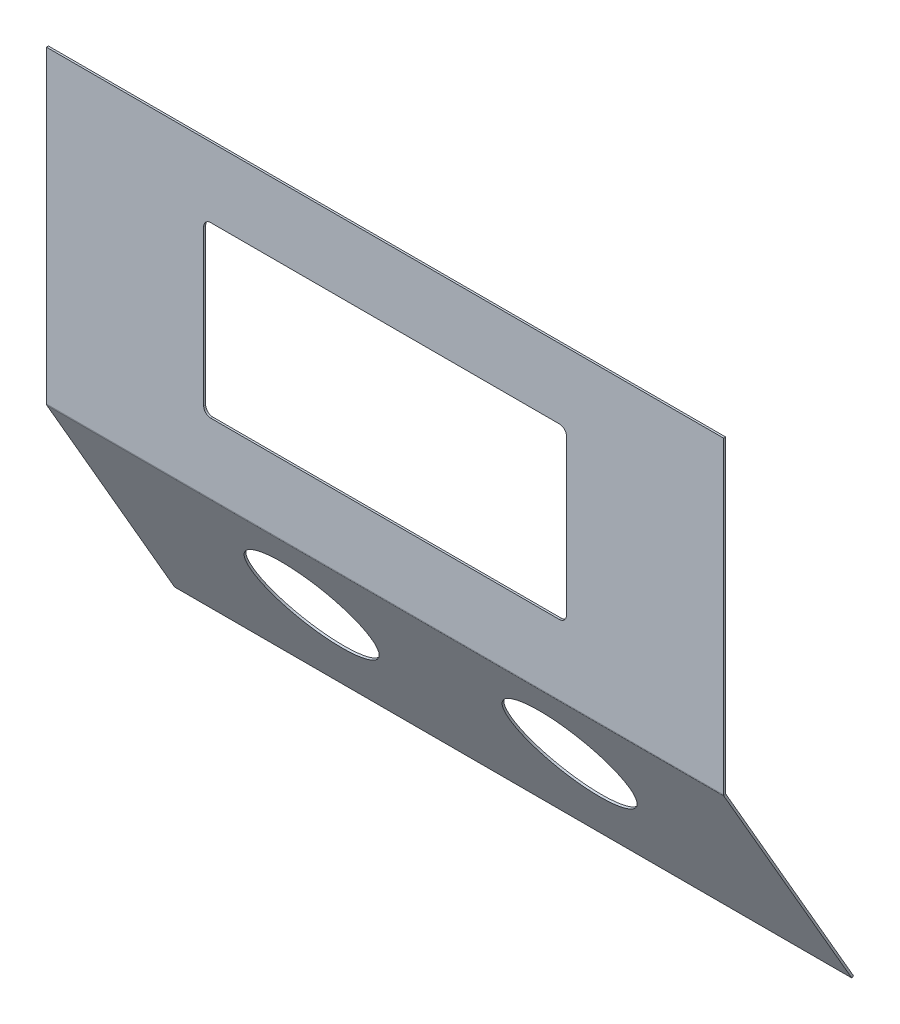
ISO-10303-21;
HEADER;
FILE_DESCRIPTION(('STEP AP214'),'2;1');
FILE_NAME('part.step','',(''),(''),'','','');
FILE_SCHEMA(('AUTOMOTIVE_DESIGN { 1 0 10303 214 1 1 1 1 }'));
ENDSEC;
DATA;
#1=APPLICATION_CONTEXT('core data for automotive mechanical design processes');
#2=APPLICATION_PROTOCOL_DEFINITION('international standard','automotive_design',2000,#1);
#3=PRODUCT_CONTEXT('',#1,'mechanical');
#4=PRODUCT('Part','Part','',(#3));
#5=PRODUCT_RELATED_PRODUCT_CATEGORY('part','',(#4));
#6=PRODUCT_DEFINITION_FORMATION('','',#4);
#7=PRODUCT_DEFINITION_CONTEXT('part definition',#1,'design');
#8=PRODUCT_DEFINITION('design','',#6,#7);
#9=PRODUCT_DEFINITION_SHAPE('','',#8);
#10=(LENGTH_UNIT() NAMED_UNIT(*) SI_UNIT(.MILLI.,.METRE.));
#11=(NAMED_UNIT(*) PLANE_ANGLE_UNIT() SI_UNIT($,.RADIAN.));
#12=(NAMED_UNIT(*) SI_UNIT($,.STERADIAN.) SOLID_ANGLE_UNIT());
#13=UNCERTAINTY_MEASURE_WITH_UNIT(LENGTH_MEASURE(1.E-05),#10,'distance_accuracy_value','');
#14=(GEOMETRIC_REPRESENTATION_CONTEXT(3) GLOBAL_UNCERTAINTY_ASSIGNED_CONTEXT((#13)) GLOBAL_UNIT_ASSIGNED_CONTEXT((#10,
#11,#12)) REPRESENTATION_CONTEXT('',''));
#15=CARTESIAN_POINT('',(0.,0.,0.));
#16=DIRECTION('',(0.,0.,1.));
#17=DIRECTION('',(1.,0.,0.));
#18=AXIS2_PLACEMENT_3D('',#15,#16,#17);
#19=CARTESIAN_POINT('',(-533.4,-388.943917309577,-198.66447275902));
#20=DIRECTION('',(0.,0.866025403784438,0.500000000000001));
#21=DIRECTION('',(0.,-0.500000000000001,0.866025403784438));
#22=AXIS2_PLACEMENT_3D('',#19,#20,#21);
#23=PLANE('',#22);
#24=DIRECTION('',(1.,0.,0.));
#25=VECTOR('',#24,1.);
#26=CARTESIAN_POINT('',(-533.4,-387.356417309577,-201.414103416036));
#27=LINE('',#26,#25);
#28=CARTESIAN_POINT('',(-533.4,-387.356417309577,-201.414103416036));
#29=VERTEX_POINT('',#28);
#30=CARTESIAN_POINT('',(533.4,-387.356417309577,-201.414103416036));
#31=VERTEX_POINT('',#30);
#32=EDGE_CURVE('E269',#29,#31,#27,.T.);
#33=ORIENTED_EDGE('',*,*,#32,.T.);
#34=DIRECTION('',(0.,0.500000000000001,-0.866025403784438));
#35=VECTOR('',#34,1.);
#36=CARTESIAN_POINT('',(533.4,-388.943917309577,-198.66447275902));
#37=LINE('',#36,#35);
#38=CARTESIAN_POINT('',(533.4,-388.943917309577,-198.66447275902));
#39=VERTEX_POINT('',#38);
#40=EDGE_CURVE('E263',#39,#31,#37,.T.);
#41=ORIENTED_EDGE('',*,*,#40,.F.);
#42=DIRECTION('',(1.,0.,0.));
#43=VECTOR('',#42,1.);
#44=CARTESIAN_POINT('',(-533.4,-388.943917309577,-198.66447275902));
#45=LINE('',#44,#43);
#46=CARTESIAN_POINT('',(-533.4,-388.943917309577,-198.66447275902));
#47=VERTEX_POINT('',#46);
#48=EDGE_CURVE('E46',#47,#39,#45,.T.);
#49=ORIENTED_EDGE('',*,*,#48,.F.);
#50=DIRECTION('',(0.,0.500000000000001,-0.866025403784438));
#51=VECTOR('',#50,1.);
#52=CARTESIAN_POINT('',(-533.4,-388.943917309577,-198.66447275902));
#53=LINE('',#52,#51);
#54=EDGE_CURVE('E266',#47,#29,#53,.T.);
#55=ORIENTED_EDGE('',*,*,#54,.T.);
#56=EDGE_LOOP('',(#33,#41,#49,#55));
#57=FACE_BOUND('',#56,.T.);
#58=ADVANCED_FACE('F37',(#57),#23,.F.);
#59=CARTESIAN_POINT('',(533.4,387.826743297328,249.80427724098));
#60=DIRECTION('',(-1.,0.,0.));
#61=DIRECTION('',(0.,-0.866025403784438,-0.500000000000001));
#62=AXIS2_PLACEMENT_3D('',#59,#60,#61);
#63=PLANE('',#62);
#64=DIRECTION('',(0.,0.500000000000001,-0.866025403784438));
#65=VECTOR('',#64,1.);
#66=CARTESIAN_POINT('',(533.4,-40.2907499999998,2.63052724097997));
#67=LINE('',#66,#65);
#68=CARTESIAN_POINT('',(533.4,-40.2907499999998,2.63052724097997));
#69=VERTEX_POINT('',#68);
#70=CARTESIAN_POINT('',(533.4,-38.7032499999998,-0.119103416035633));
#71=VERTEX_POINT('',#70);
#72=EDGE_CURVE('E41',#69,#71,#67,.T.);
#73=ORIENTED_EDGE('',*,*,#72,.F.);
#74=DIRECTION('',(0.,0.866025403784438,0.500000000000001));
#75=VECTOR('',#74,1.);
#76=CARTESIAN_POINT('',(533.4,387.826743297328,249.80427724098));
#77=LINE('',#76,#75);
#78=EDGE_CURVE('E257',#39,#69,#77,.T.);
#79=ORIENTED_EDGE('',*,*,#78,.F.);
#80=ORIENTED_EDGE('',*,*,#40,.T.);
#81=DIRECTION('',(0.,0.866025403784438,0.500000000000001));
#82=VECTOR('',#81,1.);
#83=CARTESIAN_POINT('',(533.4,389.414243297328,247.054646583965));
#84=LINE('',#83,#82);
#85=EDGE_CURVE('E260',#31,#71,#84,.T.);
#86=ORIENTED_EDGE('',*,*,#85,.T.);
#87=EDGE_LOOP('',(#73,#79,#80,#86));
#88=FACE_BOUND('',#87,.T.);
#89=ADVANCED_FACE('F288',(#88),#63,.F.);
#90=CARTESIAN_POINT('',(0.,-0.558587006124695,25.5699022409799));
#91=DIRECTION('',(0.,-0.500000000000001,0.866025403784438));
#92=DIRECTION('',(1.,0.,0.));
#93=AXIS2_PLACEMENT_3D('',#90,#91,#92);
#94=PLANE('',#93);
#95=CARTESIAN_POINT('',(-203.2,-190.970510004454,-84.3644727590201));
#96=DIRECTION('',(0.,-0.500000000000001,0.866025403784438));
#97=DIRECTION('',(0.,-0.866025403784438,-0.500000000000001));
#98=AXIS2_PLACEMENT_3D('',#95,#96,#97);
#99=CIRCLE('',#98,95.25);
#100=CARTESIAN_POINT('',(-203.2,-273.459429714922,-131.98947275902));
#101=VERTEX_POINT('',#100);
#102=EDGE_CURVE('E612',#101,#101,#99,.T.);
#103=ORIENTED_EDGE('',*,*,#102,.F.);
#104=EDGE_LOOP('',(#103));
#105=FACE_BOUND('',#104,.T.);
#106=CARTESIAN_POINT('',(203.2,-190.970510004454,-84.3644727590201));
#107=DIRECTION('',(0.,-0.500000000000001,0.866025403784438));
#108=DIRECTION('',(0.,-0.866025403784438,-0.500000000000001));
#109=AXIS2_PLACEMENT_3D('',#106,#107,#108);
#110=CIRCLE('',#109,95.25);
#111=CARTESIAN_POINT('',(203.2,-273.459429714922,-131.98947275902));
#112=VERTEX_POINT('',#111);
#113=EDGE_CURVE('E356',#112,#112,#110,.T.);
#114=ORIENTED_EDGE('',*,*,#113,.F.);
#115=EDGE_LOOP('',(#114));
#116=FACE_BOUND('',#115,.T.);
#117=ORIENTED_EDGE('',*,*,#78,.T.);
#118=DIRECTION('',(-1.,0.,0.));
#119=VECTOR('',#118,1.);
#120=CARTESIAN_POINT('',(0.,-40.2907499999999,2.63052724097996));
#121=LINE('',#120,#119);
#122=CARTESIAN_POINT('',(-533.4,-40.2907499999998,2.63052724098005));
#123=VERTEX_POINT('',#122);
#124=EDGE_CURVE('E254',#69,#123,#121,.T.);
#125=ORIENTED_EDGE('',*,*,#124,.T.);
#126=DIRECTION('',(0.,-0.866025403784438,-0.500000000000001));
#127=VECTOR('',#126,1.);
#128=CARTESIAN_POINT('',(-533.4,387.826743297328,249.80427724098));
#129=LINE('',#128,#127);
#130=EDGE_CURVE('E252',#123,#47,#129,.T.);
#131=ORIENTED_EDGE('',*,*,#130,.T.);
#132=ORIENTED_EDGE('',*,*,#48,.T.);
#133=EDGE_LOOP('',(#117,#125,#131,#132));
#134=FACE_BOUND('',#133,.T.);
#135=ADVANCED_FACE('F302',(#105,#116,#134),#94,.T.);
#136=CARTESIAN_POINT('',(-533.4,387.826743297328,249.80427724098));
#137=DIRECTION('',(1.,0.,0.));
#138=DIRECTION('',(0.,0.500000000000001,-0.866025403784438));
#139=AXIS2_PLACEMENT_3D('',#136,#137,#138);
#140=PLANE('',#139);
#141=DIRECTION('',(0.,-0.500000000000001,0.866025403784438));
#142=VECTOR('',#141,1.);
#143=CARTESIAN_POINT('',(-533.4,-40.2907499999999,2.63052724097997));
#144=LINE('',#143,#142);
#145=CARTESIAN_POINT('',(-533.4,-38.7032499999999,-0.11910341603563));
#146=VERTEX_POINT('',#145);
#147=EDGE_CURVE('E271',#146,#123,#144,.T.);
#148=ORIENTED_EDGE('',*,*,#147,.F.);
#149=DIRECTION('',(0.,-0.866025403784438,-0.500000000000001));
#150=VECTOR('',#149,1.);
#151=CARTESIAN_POINT('',(-533.4,389.414243297328,247.054646583965));
#152=LINE('',#151,#150);
#153=EDGE_CURVE('E11',#146,#29,#152,.T.);
#154=ORIENTED_EDGE('',*,*,#153,.T.);
#155=ORIENTED_EDGE('',*,*,#54,.F.);
#156=ORIENTED_EDGE('',*,*,#130,.F.);
#157=EDGE_LOOP('',(#148,#154,#155,#156));
#158=FACE_BOUND('',#157,.T.);
#159=ADVANCED_FACE('F296',(#158),#140,.F.);
#160=CARTESIAN_POINT('',(0.,1.02891299387531,22.8202715839643));
#161=DIRECTION('',(0.,-0.500000000000001,0.866025403784438));
#162=DIRECTION('',(1.,0.,0.));
#163=AXIS2_PLACEMENT_3D('',#160,#161,#162);
#164=PLANE('',#163);
#165=CARTESIAN_POINT('',(-203.2,-189.383010004454,-87.1141034160357));
#166=DIRECTION('',(0.,-0.500000000000001,0.866025403784438));
#167=DIRECTION('',(0.,-0.866025403784438,-0.500000000000001));
#168=AXIS2_PLACEMENT_3D('',#165,#166,#167);
#169=CIRCLE('',#168,95.25);
#170=CARTESIAN_POINT('',(-203.2,-271.871929714922,-134.739103416036));
#171=VERTEX_POINT('',#170);
#172=EDGE_CURVE('E351',#171,#171,#169,.F.);
#173=ORIENTED_EDGE('',*,*,#172,.F.);
#174=EDGE_LOOP('',(#173));
#175=FACE_BOUND('',#174,.T.);
#176=CARTESIAN_POINT('',(203.2,-189.383010004454,-87.1141034160357));
#177=DIRECTION('',(0.,-0.500000000000001,0.866025403784438));
#178=DIRECTION('',(0.,-0.866025403784438,-0.500000000000001));
#179=AXIS2_PLACEMENT_3D('',#176,#177,#178);
#180=CIRCLE('',#179,95.25);
#181=CARTESIAN_POINT('',(203.2,-271.871929714922,-134.739103416036));
#182=VERTEX_POINT('',#181);
#183=EDGE_CURVE('E354',#182,#182,#180,.F.);
#184=ORIENTED_EDGE('',*,*,#183,.F.);
#185=EDGE_LOOP('',(#184));
#186=FACE_BOUND('',#185,.T.);
#187=DIRECTION('',(-1.,0.,0.));
#188=VECTOR('',#187,1.);
#189=CARTESIAN_POINT('',(0.,-38.7032499999999,-0.119103416035635));
#190=LINE('',#189,#188);
#191=EDGE_CURVE('E273',#71,#146,#190,.T.);
#192=ORIENTED_EDGE('',*,*,#191,.F.);
#193=ORIENTED_EDGE('',*,*,#85,.F.);
#194=ORIENTED_EDGE('',*,*,#32,.F.);
#195=ORIENTED_EDGE('',*,*,#153,.F.);
#196=EDGE_LOOP('',(#192,#193,#194,#195));
#197=FACE_BOUND('',#196,.T.);
#198=ADVANCED_FACE('F39',(#175,#186,#197),#164,.F.);
#199=CARTESIAN_POINT('',(533.4,448.46875,3.175));
#200=DIRECTION('',(-1.,0.,0.));
#201=DIRECTION('',(0.,-1.,0.));
#202=AXIS2_PLACEMENT_3D('',#199,#200,#201);
#203=PLANE('',#202);
#204=DIRECTION('',(0.,1.,0.));
#205=VECTOR('',#204,1.);
#206=CARTESIAN_POINT('',(533.4,448.46875,3.175));
#207=LINE('',#206,#205);
#208=CARTESIAN_POINT('',(533.4,-38.2587499999998,3.175));
#209=VERTEX_POINT('',#208);
#210=CARTESIAN_POINT('',(533.4,448.46875,3.175));
#211=VERTEX_POINT('',#210);
#212=EDGE_CURVE('E224',#209,#211,#207,.T.);
#213=ORIENTED_EDGE('',*,*,#212,.F.);
#214=DIRECTION('',(0.,0.,-1.));
#215=VECTOR('',#214,1.);
#216=CARTESIAN_POINT('',(533.4,-38.2587499999998,3.175));
#217=LINE('',#216,#215);
#218=CARTESIAN_POINT('',(533.4,-38.2587499999998,0.));
#219=VERTEX_POINT('',#218);
#220=EDGE_CURVE('E240',#209,#219,#217,.T.);
#221=ORIENTED_EDGE('',*,*,#220,.T.);
#222=DIRECTION('',(0.,1.,0.));
#223=VECTOR('',#222,1.);
#224=CARTESIAN_POINT('',(533.4,448.46875,0.));
#225=LINE('',#224,#223);
#226=CARTESIAN_POINT('',(533.4,448.46875,0.));
#227=VERTEX_POINT('',#226);
#228=EDGE_CURVE('E216',#219,#227,#225,.T.);
#229=ORIENTED_EDGE('',*,*,#228,.T.);
#230=DIRECTION('',(0.,0.,-1.));
#231=VECTOR('',#230,1.);
#232=CARTESIAN_POINT('',(533.4,448.46875,3.175));
#233=LINE('',#232,#231);
#234=EDGE_CURVE('E231',#211,#227,#233,.T.);
#235=ORIENTED_EDGE('',*,*,#234,.F.);
#236=EDGE_LOOP('',(#213,#221,#229,#235));
#237=FACE_BOUND('',#236,.T.);
#238=ADVANCED_FACE('F313',(#237),#203,.F.);
#239=CARTESIAN_POINT('',(-533.4,448.46875,3.175));
#240=DIRECTION('',(1.,0.,0.));
#241=DIRECTION('',(0.,0.,-1.));
#242=AXIS2_PLACEMENT_3D('',#239,#240,#241);
#243=PLANE('',#242);
#244=DIRECTION('',(0.,-1.,0.));
#245=VECTOR('',#244,1.);
#246=CARTESIAN_POINT('',(-533.4,448.46875,0.));
#247=LINE('',#246,#245);
#248=CARTESIAN_POINT('',(-533.4,448.46875,0.));
#249=VERTEX_POINT('',#248);
#250=CARTESIAN_POINT('',(-533.4,-38.2587499999998,0.));
#251=VERTEX_POINT('',#250);
#252=EDGE_CURVE('E227',#249,#251,#247,.T.);
#253=ORIENTED_EDGE('',*,*,#252,.T.);
#254=DIRECTION('',(0.,0.,1.));
#255=VECTOR('',#254,1.);
#256=CARTESIAN_POINT('',(-533.4,-38.2587499999999,3.175));
#257=LINE('',#256,#255);
#258=CARTESIAN_POINT('',(-533.4,-38.2587499999999,3.175));
#259=VERTEX_POINT('',#258);
#260=EDGE_CURVE('E237',#251,#259,#257,.T.);
#261=ORIENTED_EDGE('',*,*,#260,.T.);
#262=DIRECTION('',(0.,-1.,0.));
#263=VECTOR('',#262,1.);
#264=CARTESIAN_POINT('',(-533.4,448.46875,3.175));
#265=LINE('',#264,#263);
#266=CARTESIAN_POINT('',(-533.4,448.46875,3.175));
#267=VERTEX_POINT('',#266);
#268=EDGE_CURVE('E223',#267,#259,#265,.T.);
#269=ORIENTED_EDGE('',*,*,#268,.F.);
#270=DIRECTION('',(0.,0.,-1.));
#271=VECTOR('',#270,1.);
#272=CARTESIAN_POINT('',(-533.4,448.46875,3.175));
#273=LINE('',#272,#271);
#274=EDGE_CURVE('E228',#267,#249,#273,.T.);
#275=ORIENTED_EDGE('',*,*,#274,.T.);
#276=EDGE_LOOP('',(#253,#261,#269,#275));
#277=FACE_BOUND('',#276,.T.);
#278=ADVANCED_FACE('F321',(#277),#243,.F.);
#279=CARTESIAN_POINT('',(0.,0.,0.));
#280=DIRECTION('',(0.,0.,1.));
#281=DIRECTION('',(1.,0.,0.));
#282=AXIS2_PLACEMENT_3D('',#279,#280,#281);
#283=PLANE('',#282);
#284=DIRECTION('',(0.,1.,0.));
#285=VECTOR('',#284,1.);
#286=CARTESIAN_POINT('',(-285.75,327.3425,0.));
#287=LINE('',#286,#285);
#288=CARTESIAN_POINT('',(-285.75,82.8674999999997,0.));
#289=VERTEX_POINT('',#288);
#290=CARTESIAN_POINT('',(-285.75,327.3425,0.));
#291=VERTEX_POINT('',#290);
#292=EDGE_CURVE('E172',#289,#291,#287,.T.);
#293=ORIENTED_EDGE('',*,*,#292,.F.);
#294=CARTESIAN_POINT('',(-274.6375,82.8674999999997,0.));
#295=DIRECTION('',(0.,0.,1.));
#296=DIRECTION('',(1.,0.,0.));
#297=AXIS2_PLACEMENT_3D('',#294,#295,#296);
#298=CIRCLE('',#297,11.1125);
#299=CARTESIAN_POINT('',(-274.6375,71.7549999999997,0.));
#300=VERTEX_POINT('',#299);
#301=EDGE_CURVE('E153',#300,#289,#298,.F.);
#302=ORIENTED_EDGE('',*,*,#301,.F.);
#303=DIRECTION('',(-1.,0.,0.));
#304=VECTOR('',#303,1.);
#305=CARTESIAN_POINT('',(-274.6375,71.7549999999997,0.));
#306=LINE('',#305,#304);
#307=CARTESIAN_POINT('',(274.6375,71.7549999999997,0.));
#308=VERTEX_POINT('',#307);
#309=EDGE_CURVE('E162',#308,#300,#306,.T.);
#310=ORIENTED_EDGE('',*,*,#309,.F.);
#311=CARTESIAN_POINT('',(274.6375,82.8674999999997,0.));
#312=DIRECTION('',(0.,0.,1.));
#313=DIRECTION('',(1.,0.,0.));
#314=AXIS2_PLACEMENT_3D('',#311,#312,#313);
#315=CIRCLE('',#314,11.1125);
#316=CARTESIAN_POINT('',(285.75,82.8674999999997,0.));
#317=VERTEX_POINT('',#316);
#318=EDGE_CURVE('E54',#317,#308,#315,.F.);
#319=ORIENTED_EDGE('',*,*,#318,.F.);
#320=DIRECTION('',(0.,-1.,0.));
#321=VECTOR('',#320,1.);
#322=CARTESIAN_POINT('',(285.75,327.3425,0.));
#323=LINE('',#322,#321);
#324=CARTESIAN_POINT('',(285.75,327.3425,0.));
#325=VERTEX_POINT('',#324);
#326=EDGE_CURVE('E358',#325,#317,#323,.T.);
#327=ORIENTED_EDGE('',*,*,#326,.F.);
#328=CARTESIAN_POINT('',(274.6375,327.3425,0.));
#329=DIRECTION('',(0.,0.,1.));
#330=DIRECTION('',(1.,0.,0.));
#331=AXIS2_PLACEMENT_3D('',#328,#329,#330);
#332=CIRCLE('',#331,11.1125);
#333=CARTESIAN_POINT('',(274.6375,338.455,0.));
#334=VERTEX_POINT('',#333);
#335=EDGE_CURVE('E366',#334,#325,#332,.F.);
#336=ORIENTED_EDGE('',*,*,#335,.F.);
#337=DIRECTION('',(1.,0.,0.));
#338=VECTOR('',#337,1.);
#339=CARTESIAN_POINT('',(-274.6375,338.455,0.));
#340=LINE('',#339,#338);
#341=CARTESIAN_POINT('',(-274.6375,338.455,0.));
#342=VERTEX_POINT('',#341);
#343=EDGE_CURVE('E369',#342,#334,#340,.T.);
#344=ORIENTED_EDGE('',*,*,#343,.F.);
#345=CARTESIAN_POINT('',(-274.6375,327.3425,0.));
#346=DIRECTION('',(0.,0.,1.));
#347=DIRECTION('',(1.,0.,0.));
#348=AXIS2_PLACEMENT_3D('',#345,#346,#347);
#349=CIRCLE('',#348,11.1125);
#350=EDGE_CURVE('E176',#291,#342,#349,.F.);
#351=ORIENTED_EDGE('',*,*,#350,.F.);
#352=EDGE_LOOP('',(#293,#302,#310,#319,#327,#336,#344,#351));
#353=FACE_BOUND('',#352,.T.);
#354=ORIENTED_EDGE('',*,*,#228,.F.);
#355=DIRECTION('',(-1.,0.,0.));
#356=VECTOR('',#355,1.);
#357=CARTESIAN_POINT('',(0.,-38.2587499999999,0.));
#358=LINE('',#357,#356);
#359=EDGE_CURVE('E234',#219,#251,#358,.T.);
#360=ORIENTED_EDGE('',*,*,#359,.T.);
#361=ORIENTED_EDGE('',*,*,#252,.F.);
#362=DIRECTION('',(-1.,0.,0.));
#363=VECTOR('',#362,1.);
#364=CARTESIAN_POINT('',(-533.4,448.46875,0.));
#365=LINE('',#364,#363);
#366=EDGE_CURVE('E225',#227,#249,#365,.T.);
#367=ORIENTED_EDGE('',*,*,#366,.F.);
#368=EDGE_LOOP('',(#354,#360,#361,#367));
#369=FACE_BOUND('',#368,.T.);
#370=ADVANCED_FACE('F168',(#353,#369),#283,.F.);
#371=CARTESIAN_POINT('',(-533.4,448.46875,3.175));
#372=DIRECTION('',(0.,-1.,0.));
#373=DIRECTION('',(0.,0.,-1.));
#374=AXIS2_PLACEMENT_3D('',#371,#372,#373);
#375=PLANE('',#374);
#376=ORIENTED_EDGE('',*,*,#366,.T.);
#377=ORIENTED_EDGE('',*,*,#274,.F.);
#378=DIRECTION('',(-1.,0.,0.));
#379=VECTOR('',#378,1.);
#380=CARTESIAN_POINT('',(-533.4,448.46875,3.175));
#381=LINE('',#380,#379);
#382=EDGE_CURVE('E221',#211,#267,#381,.T.);
#383=ORIENTED_EDGE('',*,*,#382,.F.);
#384=ORIENTED_EDGE('',*,*,#234,.T.);
#385=EDGE_LOOP('',(#376,#377,#383,#384));
#386=FACE_BOUND('',#385,.T.);
#387=ADVANCED_FACE('F317',(#386),#375,.F.);
#388=CARTESIAN_POINT('',(0.,0.,3.175));
#389=DIRECTION('',(0.,0.,1.));
#390=DIRECTION('',(1.,0.,0.));
#391=AXIS2_PLACEMENT_3D('',#388,#389,#390);
#392=PLANE('',#391);
#393=CARTESIAN_POINT('',(-274.6375,82.8674999999997,3.175));
#394=DIRECTION('',(0.,0.,1.));
#395=DIRECTION('',(1.,0.,0.));
#396=AXIS2_PLACEMENT_3D('',#393,#394,#395);
#397=CIRCLE('',#396,11.1125);
#398=CARTESIAN_POINT('',(-285.75,82.8674999999997,3.175));
#399=VERTEX_POINT('',#398);
#400=CARTESIAN_POINT('',(-274.6375,71.7549999999997,3.175));
#401=VERTEX_POINT('',#400);
#402=EDGE_CURVE('E62',#399,#401,#397,.T.);
#403=ORIENTED_EDGE('',*,*,#402,.F.);
#404=DIRECTION('',(0.,-1.,0.));
#405=VECTOR('',#404,1.);
#406=CARTESIAN_POINT('',(-285.75,327.3425,3.175));
#407=LINE('',#406,#405);
#408=CARTESIAN_POINT('',(-285.75,327.3425,3.175));
#409=VERTEX_POINT('',#408);
#410=EDGE_CURVE('E159',#409,#399,#407,.T.);
#411=ORIENTED_EDGE('',*,*,#410,.F.);
#412=CARTESIAN_POINT('',(-274.6375,327.3425,3.175));
#413=DIRECTION('',(0.,0.,1.));
#414=DIRECTION('',(1.,0.,0.));
#415=AXIS2_PLACEMENT_3D('',#412,#413,#414);
#416=CIRCLE('',#415,11.1125);
#417=CARTESIAN_POINT('',(-274.6375,338.455,3.175));
#418=VERTEX_POINT('',#417);
#419=EDGE_CURVE('E193',#418,#409,#416,.T.);
#420=ORIENTED_EDGE('',*,*,#419,.F.);
#421=DIRECTION('',(-1.,0.,0.));
#422=VECTOR('',#421,1.);
#423=CARTESIAN_POINT('',(-274.6375,338.455,3.175));
#424=LINE('',#423,#422);
#425=CARTESIAN_POINT('',(274.6375,338.455,3.175));
#426=VERTEX_POINT('',#425);
#427=EDGE_CURVE('E190',#426,#418,#424,.T.);
#428=ORIENTED_EDGE('',*,*,#427,.F.);
#429=CARTESIAN_POINT('',(274.6375,327.3425,3.175));
#430=DIRECTION('',(0.,0.,1.));
#431=DIRECTION('',(1.,0.,0.));
#432=AXIS2_PLACEMENT_3D('',#429,#430,#431);
#433=CIRCLE('',#432,11.1125);
#434=CARTESIAN_POINT('',(285.75,327.3425,3.175));
#435=VERTEX_POINT('',#434);
#436=EDGE_CURVE('E187',#435,#426,#433,.T.);
#437=ORIENTED_EDGE('',*,*,#436,.F.);
#438=DIRECTION('',(0.,1.,0.));
#439=VECTOR('',#438,1.);
#440=CARTESIAN_POINT('',(285.75,327.3425,3.175));
#441=LINE('',#440,#439);
#442=CARTESIAN_POINT('',(285.75,82.8674999999997,3.175));
#443=VERTEX_POINT('',#442);
#444=EDGE_CURVE('E184',#443,#435,#441,.T.);
#445=ORIENTED_EDGE('',*,*,#444,.F.);
#446=CARTESIAN_POINT('',(274.6375,82.8674999999997,3.175));
#447=DIRECTION('',(0.,0.,1.));
#448=DIRECTION('',(1.,0.,0.));
#449=AXIS2_PLACEMENT_3D('',#446,#447,#448);
#450=CIRCLE('',#449,11.1125);
#451=CARTESIAN_POINT('',(274.6375,71.7549999999997,3.175));
#452=VERTEX_POINT('',#451);
#453=EDGE_CURVE('E181',#452,#443,#450,.T.);
#454=ORIENTED_EDGE('',*,*,#453,.F.);
#455=DIRECTION('',(1.,0.,0.));
#456=VECTOR('',#455,1.);
#457=CARTESIAN_POINT('',(-274.6375,71.7549999999997,3.175));
#458=LINE('',#457,#456);
#459=EDGE_CURVE('E174',#401,#452,#458,.T.);
#460=ORIENTED_EDGE('',*,*,#459,.F.);
#461=EDGE_LOOP('',(#403,#411,#420,#428,#437,#445,#454,#460));
#462=FACE_BOUND('',#461,.T.);
#463=DIRECTION('',(-1.,0.,0.));
#464=VECTOR('',#463,1.);
#465=CARTESIAN_POINT('',(0.,-38.2587499999999,3.175));
#466=LINE('',#465,#464);
#467=EDGE_CURVE('E243',#209,#259,#466,.T.);
#468=ORIENTED_EDGE('',*,*,#467,.F.);
#469=ORIENTED_EDGE('',*,*,#212,.T.);
#470=ORIENTED_EDGE('',*,*,#382,.T.);
#471=ORIENTED_EDGE('',*,*,#268,.T.);
#472=EDGE_LOOP('',(#468,#469,#470,#471));
#473=FACE_BOUND('',#472,.T.);
#474=ADVANCED_FACE('F308',(#462,#473),#392,.T.);
#475=CARTESIAN_POINT('',(533.4,-38.2587499999998,-0.889));
#476=DIRECTION('',(1.,0.,0.));
#477=DIRECTION('',(0.,0.,-1.));
#478=AXIS2_PLACEMENT_3D('',#475,#476,#477);
#479=PLANE('',#478);
#480=ORIENTED_EDGE('',*,*,#72,.T.);
#481=CARTESIAN_POINT('',(533.4,-38.2587499999998,-0.889));
#482=DIRECTION('',(-1.,0.,0.));
#483=DIRECTION('',(0.,-1.,0.));
#484=AXIS2_PLACEMENT_3D('',#481,#482,#483);
#485=CIRCLE('',#484,0.888999999999999);
#486=EDGE_CURVE('E165',#71,#219,#485,.T.);
#487=ORIENTED_EDGE('',*,*,#486,.T.);
#488=ORIENTED_EDGE('',*,*,#220,.F.);
#489=CARTESIAN_POINT('',(533.4,-38.2587499999998,-0.889));
#490=DIRECTION('',(-1.,0.,0.));
#491=DIRECTION('',(0.,-1.,0.));
#492=AXIS2_PLACEMENT_3D('',#489,#490,#491);
#493=CIRCLE('',#492,4.064);
#494=EDGE_CURVE('E210',#69,#209,#493,.T.);
#495=ORIENTED_EDGE('',*,*,#494,.F.);
#496=EDGE_LOOP('',(#480,#487,#488,#495));
#497=FACE_BOUND('',#496,.T.);
#498=ADVANCED_FACE('F280',(#497),#479,.T.);
#499=CARTESIAN_POINT('',(-533.4,-38.2587499999999,-0.889));
#500=DIRECTION('',(-1.,0.,0.));
#501=DIRECTION('',(0.,0.,1.));
#502=AXIS2_PLACEMENT_3D('',#499,#500,#501);
#503=PLANE('',#502);
#504=CARTESIAN_POINT('',(-533.4,-38.2587499999999,-0.889));
#505=DIRECTION('',(-1.,0.,0.));
#506=DIRECTION('',(0.,-1.,0.));
#507=AXIS2_PLACEMENT_3D('',#504,#505,#506);
#508=CIRCLE('',#507,0.888999999999999);
#509=EDGE_CURVE('E214',#251,#146,#508,.F.);
#510=ORIENTED_EDGE('',*,*,#509,.T.);
#511=ORIENTED_EDGE('',*,*,#147,.T.);
#512=CARTESIAN_POINT('',(-533.4,-38.2587499999999,-0.889));
#513=DIRECTION('',(-1.,0.,0.));
#514=DIRECTION('',(0.,-1.,0.));
#515=AXIS2_PLACEMENT_3D('',#512,#513,#514);
#516=CIRCLE('',#515,4.064);
#517=EDGE_CURVE('E213',#259,#123,#516,.F.);
#518=ORIENTED_EDGE('',*,*,#517,.F.);
#519=ORIENTED_EDGE('',*,*,#260,.F.);
#520=EDGE_LOOP('',(#510,#511,#518,#519));
#521=FACE_BOUND('',#520,.T.);
#522=ADVANCED_FACE('F299',(#521),#503,.T.);
#523=CARTESIAN_POINT('',(1927.1608114491,-38.2587499999997,-0.889));
#524=DIRECTION('',(-1.,0.,0.));
#525=DIRECTION('',(0.,-1.,0.));
#526=AXIS2_PLACEMENT_3D('',#523,#524,#525);
#527=CYLINDRICAL_SURFACE('',#526,4.064);
#528=ORIENTED_EDGE('',*,*,#467,.T.);
#529=ORIENTED_EDGE('',*,*,#517,.T.);
#530=ORIENTED_EDGE('',*,*,#124,.F.);
#531=ORIENTED_EDGE('',*,*,#494,.T.);
#532=EDGE_LOOP('',(#528,#529,#530,#531));
#533=FACE_BOUND('',#532,.T.);
#534=ADVANCED_FACE('F304',(#533),#527,.T.);
#535=CARTESIAN_POINT('',(1927.1608114491,-38.2587499999997,-0.889));
#536=DIRECTION('',(-1.,0.,0.));
#537=DIRECTION('',(0.,-1.,0.));
#538=AXIS2_PLACEMENT_3D('',#535,#536,#537);
#539=CYLINDRICAL_SURFACE('',#538,0.888999999999999);
#540=ORIENTED_EDGE('',*,*,#359,.F.);
#541=ORIENTED_EDGE('',*,*,#486,.F.);
#542=ORIENTED_EDGE('',*,*,#191,.T.);
#543=ORIENTED_EDGE('',*,*,#509,.F.);
#544=EDGE_LOOP('',(#540,#541,#542,#543));
#545=FACE_BOUND('',#544,.T.);
#546=ADVANCED_FACE('F283',(#545),#539,.F.);
#547=CARTESIAN_POINT('',(-274.6375,82.8674999999997,-201.415103416036));
#548=DIRECTION('',(0.,0.,1.));
#549=DIRECTION('',(1.,0.,0.));
#550=AXIS2_PLACEMENT_3D('',#547,#548,#549);
#551=CYLINDRICAL_SURFACE('',#550,11.1125);
#552=ORIENTED_EDGE('',*,*,#301,.T.);
#553=DIRECTION('',(0.,0.,1.));
#554=VECTOR('',#553,1.);
#555=CARTESIAN_POINT('',(-285.75,82.8674999999997,-201.415103416036));
#556=LINE('',#555,#554);
#557=EDGE_CURVE('E166',#289,#399,#556,.T.);
#558=ORIENTED_EDGE('',*,*,#557,.T.);
#559=ORIENTED_EDGE('',*,*,#402,.T.);
#560=DIRECTION('',(0.,0.,1.));
#561=VECTOR('',#560,1.);
#562=CARTESIAN_POINT('',(-274.6375,71.7549999999997,-201.415103416036));
#563=LINE('',#562,#561);
#564=EDGE_CURVE('E149',#300,#401,#563,.T.);
#565=ORIENTED_EDGE('',*,*,#564,.F.);
#566=EDGE_LOOP('',(#552,#558,#559,#565));
#567=FACE_BOUND('',#566,.T.);
#568=ADVANCED_FACE('F151',(#567),#551,.F.);
#569=CARTESIAN_POINT('',(-285.75,327.3425,-201.415103416036));
#570=DIRECTION('',(-1.,0.,0.));
#571=DIRECTION('',(0.,0.,1.));
#572=AXIS2_PLACEMENT_3D('',#569,#570,#571);
#573=PLANE('',#572);
#574=ORIENTED_EDGE('',*,*,#292,.T.);
#575=DIRECTION('',(0.,0.,1.));
#576=VECTOR('',#575,1.);
#577=CARTESIAN_POINT('',(-285.75,327.3425,-201.415103416036));
#578=LINE('',#577,#576);
#579=EDGE_CURVE('E199',#291,#409,#578,.T.);
#580=ORIENTED_EDGE('',*,*,#579,.T.);
#581=ORIENTED_EDGE('',*,*,#410,.T.);
#582=ORIENTED_EDGE('',*,*,#557,.F.);
#583=EDGE_LOOP('',(#574,#580,#581,#582));
#584=FACE_BOUND('',#583,.T.);
#585=ADVANCED_FACE('F385',(#584),#573,.F.);
#586=CARTESIAN_POINT('',(-274.6375,327.3425,-201.415103416036));
#587=DIRECTION('',(0.,0.,1.));
#588=DIRECTION('',(1.,0.,0.));
#589=AXIS2_PLACEMENT_3D('',#586,#587,#588);
#590=CYLINDRICAL_SURFACE('',#589,11.1125);
#591=ORIENTED_EDGE('',*,*,#350,.T.);
#592=DIRECTION('',(0.,0.,1.));
#593=VECTOR('',#592,1.);
#594=CARTESIAN_POINT('',(-274.6375,338.455,-201.415103416036));
#595=LINE('',#594,#593);
#596=EDGE_CURVE('E201',#342,#418,#595,.T.);
#597=ORIENTED_EDGE('',*,*,#596,.T.);
#598=ORIENTED_EDGE('',*,*,#419,.T.);
#599=ORIENTED_EDGE('',*,*,#579,.F.);
#600=EDGE_LOOP('',(#591,#597,#598,#599));
#601=FACE_BOUND('',#600,.T.);
#602=ADVANCED_FACE('F374',(#601),#590,.F.);
#603=CARTESIAN_POINT('',(-274.6375,338.455,-201.415103416036));
#604=DIRECTION('',(0.,1.,0.));
#605=DIRECTION('',(0.,0.,1.));
#606=AXIS2_PLACEMENT_3D('',#603,#604,#605);
#607=PLANE('',#606);
#608=ORIENTED_EDGE('',*,*,#343,.T.);
#609=DIRECTION('',(0.,0.,1.));
#610=VECTOR('',#609,1.);
#611=CARTESIAN_POINT('',(274.6375,338.455,-201.415103416036));
#612=LINE('',#611,#610);
#613=EDGE_CURVE('E203',#334,#426,#612,.T.);
#614=ORIENTED_EDGE('',*,*,#613,.T.);
#615=ORIENTED_EDGE('',*,*,#427,.T.);
#616=ORIENTED_EDGE('',*,*,#596,.F.);
#617=EDGE_LOOP('',(#608,#614,#615,#616));
#618=FACE_BOUND('',#617,.T.);
#619=ADVANCED_FACE('F378',(#618),#607,.F.);
#620=CARTESIAN_POINT('',(274.6375,327.3425,-201.415103416036));
#621=DIRECTION('',(0.,0.,1.));
#622=DIRECTION('',(1.,0.,0.));
#623=AXIS2_PLACEMENT_3D('',#620,#621,#622);
#624=CYLINDRICAL_SURFACE('',#623,11.1125);
#625=ORIENTED_EDGE('',*,*,#335,.T.);
#626=DIRECTION('',(0.,0.,1.));
#627=VECTOR('',#626,1.);
#628=CARTESIAN_POINT('',(285.75,327.3425,-201.415103416036));
#629=LINE('',#628,#627);
#630=EDGE_CURVE('E205',#325,#435,#629,.T.);
#631=ORIENTED_EDGE('',*,*,#630,.T.);
#632=ORIENTED_EDGE('',*,*,#436,.T.);
#633=ORIENTED_EDGE('',*,*,#613,.F.);
#634=EDGE_LOOP('',(#625,#631,#632,#633));
#635=FACE_BOUND('',#634,.T.);
#636=ADVANCED_FACE('F400',(#635),#624,.F.);
#637=CARTESIAN_POINT('',(285.75,327.3425,-201.415103416036));
#638=DIRECTION('',(1.,0.,0.));
#639=DIRECTION('',(0.,0.,-1.));
#640=AXIS2_PLACEMENT_3D('',#637,#638,#639);
#641=PLANE('',#640);
#642=ORIENTED_EDGE('',*,*,#326,.T.);
#643=DIRECTION('',(0.,0.,1.));
#644=VECTOR('',#643,1.);
#645=CARTESIAN_POINT('',(285.75,82.8674999999997,-201.415103416036));
#646=LINE('',#645,#644);
#647=EDGE_CURVE('E207',#317,#443,#646,.T.);
#648=ORIENTED_EDGE('',*,*,#647,.T.);
#649=ORIENTED_EDGE('',*,*,#444,.T.);
#650=ORIENTED_EDGE('',*,*,#630,.F.);
#651=EDGE_LOOP('',(#642,#648,#649,#650));
#652=FACE_BOUND('',#651,.T.);
#653=ADVANCED_FACE('F403',(#652),#641,.F.);
#654=CARTESIAN_POINT('',(274.6375,82.8674999999997,-201.415103416036));
#655=DIRECTION('',(0.,0.,1.));
#656=DIRECTION('',(1.,0.,0.));
#657=AXIS2_PLACEMENT_3D('',#654,#655,#656);
#658=CYLINDRICAL_SURFACE('',#657,11.1125);
#659=ORIENTED_EDGE('',*,*,#318,.T.);
#660=DIRECTION('',(0.,0.,1.));
#661=VECTOR('',#660,1.);
#662=CARTESIAN_POINT('',(274.6375,71.7549999999997,-201.415103416036));
#663=LINE('',#662,#661);
#664=EDGE_CURVE('E158',#308,#452,#663,.T.);
#665=ORIENTED_EDGE('',*,*,#664,.T.);
#666=ORIENTED_EDGE('',*,*,#453,.T.);
#667=ORIENTED_EDGE('',*,*,#647,.F.);
#668=EDGE_LOOP('',(#659,#665,#666,#667));
#669=FACE_BOUND('',#668,.T.);
#670=ADVANCED_FACE('F407',(#669),#658,.F.);
#671=CARTESIAN_POINT('',(-274.6375,71.7549999999997,-201.415103416036));
#672=DIRECTION('',(0.,-1.,0.));
#673=DIRECTION('',(0.,0.,-1.));
#674=AXIS2_PLACEMENT_3D('',#671,#672,#673);
#675=PLANE('',#674);
#676=ORIENTED_EDGE('',*,*,#309,.T.);
#677=ORIENTED_EDGE('',*,*,#564,.T.);
#678=ORIENTED_EDGE('',*,*,#459,.T.);
#679=ORIENTED_EDGE('',*,*,#664,.F.);
#680=EDGE_LOOP('',(#676,#677,#678,#679));
#681=FACE_BOUND('',#680,.T.);
#682=ADVANCED_FACE('F163',(#681),#675,.F.);
#683=CARTESIAN_POINT('',(203.2,19.5739648356429,-449.038200434974));
#684=DIRECTION('',(0.,-0.500000000000001,0.866025403784438));
#685=DIRECTION('',(0.,-0.866025403784438,-0.500000000000001));
#686=AXIS2_PLACEMENT_3D('',#683,#684,#685);
#687=CYLINDRICAL_SURFACE('',#686,95.25);
#688=ORIENTED_EDGE('',*,*,#113,.T.);
#689=EDGE_LOOP('',(#688));
#690=FACE_BOUND('',#689,.T.);
#691=ORIENTED_EDGE('',*,*,#183,.T.);
#692=EDGE_LOOP('',(#691));
#693=FACE_BOUND('',#692,.T.);
#694=ADVANCED_FACE('F395',(#690,#693),#687,.F.);
#695=CARTESIAN_POINT('',(-203.2,19.5739648356428,-449.038200434974));
#696=DIRECTION('',(0.,-0.500000000000001,0.866025403784438));
#697=DIRECTION('',(0.,-0.866025403784438,-0.500000000000001));
#698=AXIS2_PLACEMENT_3D('',#695,#696,#697);
#699=CYLINDRICAL_SURFACE('',#698,95.25);
#700=ORIENTED_EDGE('',*,*,#102,.T.);
#701=EDGE_LOOP('',(#700));
#702=FACE_BOUND('',#701,.T.);
#703=ORIENTED_EDGE('',*,*,#172,.T.);
#704=EDGE_LOOP('',(#703));
#705=FACE_BOUND('',#704,.T.);
#706=ADVANCED_FACE('F514',(#702,#705),#699,.F.);
#707=CLOSED_SHELL('',(#58,#89,#135,#159,#198,#238,#278,#370,#387,#474,#498,#522,#534,#546,#568,
#585,#602,#619,#636,#653,#670,#682,#694,#706));
#708=MANIFOLD_SOLID_BREP('B2',#707);
#709=ADVANCED_BREP_SHAPE_REPRESENTATION('',(#18,#708),#14);
#710=SHAPE_DEFINITION_REPRESENTATION(#9,#709);
ENDSEC;
END-ISO-10303-21;
